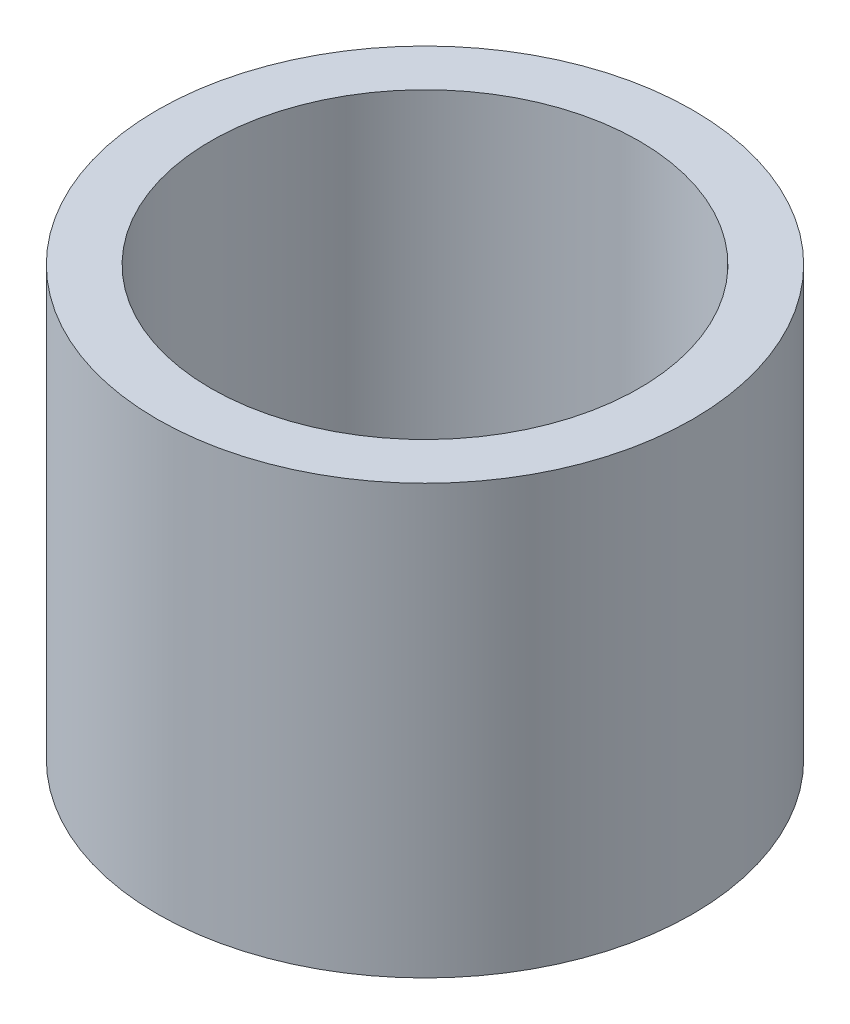
ISO-10303-21;
HEADER;
FILE_DESCRIPTION(('STEP AP214'),'2;1');
FILE_NAME('part.step','',(''),(''),'','','');
FILE_SCHEMA(('AUTOMOTIVE_DESIGN { 1 0 10303 214 1 1 1 1 }'));
ENDSEC;
DATA;
#1=APPLICATION_CONTEXT('core data for automotive mechanical design processes');
#2=APPLICATION_PROTOCOL_DEFINITION('international standard','automotive_design',2000,#1);
#3=PRODUCT_CONTEXT('',#1,'mechanical');
#4=PRODUCT('Part','Part','',(#3));
#5=PRODUCT_RELATED_PRODUCT_CATEGORY('part','',(#4));
#6=PRODUCT_DEFINITION_FORMATION('','',#4);
#7=PRODUCT_DEFINITION_CONTEXT('part definition',#1,'design');
#8=PRODUCT_DEFINITION('design','',#6,#7);
#9=PRODUCT_DEFINITION_SHAPE('','',#8);
#10=(LENGTH_UNIT() NAMED_UNIT(*) SI_UNIT(.MILLI.,.METRE.));
#11=(NAMED_UNIT(*) PLANE_ANGLE_UNIT() SI_UNIT($,.RADIAN.));
#12=(NAMED_UNIT(*) SI_UNIT($,.STERADIAN.) SOLID_ANGLE_UNIT());
#13=UNCERTAINTY_MEASURE_WITH_UNIT(LENGTH_MEASURE(1.E-05),#10,'distance_accuracy_value','');
#14=(GEOMETRIC_REPRESENTATION_CONTEXT(3) GLOBAL_UNCERTAINTY_ASSIGNED_CONTEXT((#13)) GLOBAL_UNIT_ASSIGNED_CONTEXT((#10,
#11,#12)) REPRESENTATION_CONTEXT('',''));
#15=CARTESIAN_POINT('',(0.,0.,0.));
#16=DIRECTION('',(0.,0.,1.));
#17=DIRECTION('',(1.,0.,0.));
#18=AXIS2_PLACEMENT_3D('',#15,#16,#17);
#19=CARTESIAN_POINT('',(0.,48.,0.));
#20=DIRECTION('',(0.,1.,0.));
#21=DIRECTION('',(0.,0.,1.));
#22=AXIS2_PLACEMENT_3D('',#19,#20,#21);
#23=PLANE('',#22);
#24=CARTESIAN_POINT('',(0.,48.,0.));
#25=DIRECTION('',(0.,1.,0.));
#26=DIRECTION('',(0.,0.,1.));
#27=AXIS2_PLACEMENT_3D('',#24,#25,#26);
#28=CIRCLE('',#27,52.5);
#29=CARTESIAN_POINT('',(0.,48.,52.5));
#30=VERTEX_POINT('',#29);
#31=EDGE_CURVE('E10',#30,#30,#28,.T.);
#32=ORIENTED_EDGE('',*,*,#31,.T.);
#33=EDGE_LOOP('',(#32));
#34=FACE_BOUND('',#33,.T.);
#35=CARTESIAN_POINT('',(0.,48.,0.));
#36=DIRECTION('',(0.,1.,0.));
#37=DIRECTION('',(0.,0.,1.));
#38=AXIS2_PLACEMENT_3D('',#35,#36,#37);
#39=CIRCLE('',#38,42.);
#40=CARTESIAN_POINT('',(0.,48.,42.));
#41=VERTEX_POINT('',#40);
#42=EDGE_CURVE('E47',#41,#41,#39,.T.);
#43=ORIENTED_EDGE('',*,*,#42,.F.);
#44=EDGE_LOOP('',(#43));
#45=FACE_BOUND('',#44,.T.);
#46=ADVANCED_FACE('F36',(#34,#45),#23,.T.);
#47=CARTESIAN_POINT('',(0.,-36.,0.));
#48=DIRECTION('',(0.,1.,0.));
#49=DIRECTION('',(0.,0.,1.));
#50=AXIS2_PLACEMENT_3D('',#47,#48,#49);
#51=PLANE('',#50);
#52=CARTESIAN_POINT('',(0.,-36.,0.));
#53=DIRECTION('',(0.,1.,0.));
#54=DIRECTION('',(0.,0.,1.));
#55=AXIS2_PLACEMENT_3D('',#52,#53,#54);
#56=CIRCLE('',#55,52.5);
#57=CARTESIAN_POINT('',(0.,-36.,52.5));
#58=VERTEX_POINT('',#57);
#59=EDGE_CURVE('E40',#58,#58,#56,.T.);
#60=ORIENTED_EDGE('',*,*,#59,.F.);
#61=EDGE_LOOP('',(#60));
#62=FACE_BOUND('',#61,.T.);
#63=CARTESIAN_POINT('',(0.,-36.,0.));
#64=DIRECTION('',(0.,1.,0.));
#65=DIRECTION('',(0.,0.,1.));
#66=AXIS2_PLACEMENT_3D('',#63,#64,#65);
#67=CIRCLE('',#66,42.);
#68=CARTESIAN_POINT('',(0.,-36.,42.));
#69=VERTEX_POINT('',#68);
#70=EDGE_CURVE('E49',#69,#69,#67,.T.);
#71=ORIENTED_EDGE('',*,*,#70,.T.);
#72=EDGE_LOOP('',(#71));
#73=FACE_BOUND('',#72,.T.);
#74=ADVANCED_FACE('F59',(#62,#73),#51,.F.);
#75=CARTESIAN_POINT('',(0.,48.,0.));
#76=DIRECTION('',(0.,-1.,0.));
#77=DIRECTION('',(0.,0.,-1.));
#78=AXIS2_PLACEMENT_3D('',#75,#76,#77);
#79=CYLINDRICAL_SURFACE('',#78,52.5);
#80=ORIENTED_EDGE('',*,*,#31,.F.);
#81=EDGE_LOOP('',(#80));
#82=FACE_BOUND('',#81,.T.);
#83=ORIENTED_EDGE('',*,*,#59,.T.);
#84=EDGE_LOOP('',(#83));
#85=FACE_BOUND('',#84,.T.);
#86=ADVANCED_FACE('F38',(#82,#85),#79,.T.);
#87=CARTESIAN_POINT('',(0.,48.,0.));
#88=DIRECTION('',(0.,-1.,0.));
#89=DIRECTION('',(0.,0.,-1.));
#90=AXIS2_PLACEMENT_3D('',#87,#88,#89);
#91=CYLINDRICAL_SURFACE('',#90,42.);
#92=ORIENTED_EDGE('',*,*,#42,.T.);
#93=EDGE_LOOP('',(#92));
#94=FACE_BOUND('',#93,.T.);
#95=ORIENTED_EDGE('',*,*,#70,.F.);
#96=EDGE_LOOP('',(#95));
#97=FACE_BOUND('',#96,.T.);
#98=ADVANCED_FACE('F55',(#94,#97),#91,.F.);
#99=CLOSED_SHELL('',(#46,#74,#86,#98));
#100=MANIFOLD_SOLID_BREP('B2',#99);
#101=ADVANCED_BREP_SHAPE_REPRESENTATION('',(#18,#100),#14);
#102=SHAPE_DEFINITION_REPRESENTATION(#9,#101);
ENDSEC;
END-ISO-10303-21;
